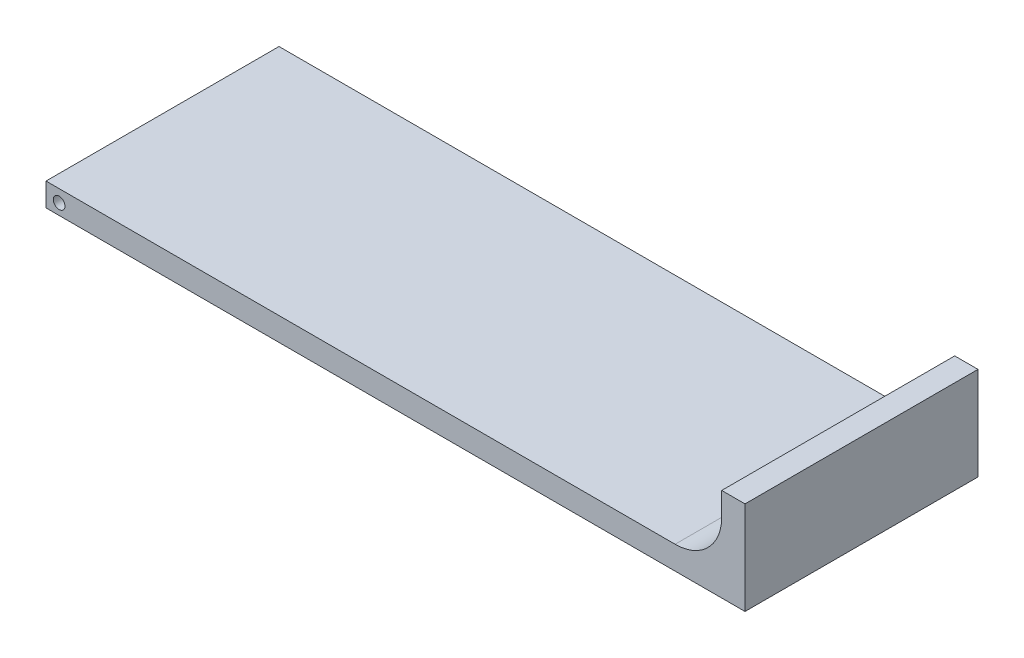
ISO-10303-21;
HEADER;
FILE_DESCRIPTION(('STEP AP214'),'2;1');
FILE_NAME('part.step','',(''),(''),'','','');
FILE_SCHEMA(('AUTOMOTIVE_DESIGN { 1 0 10303 214 1 1 1 1 }'));
ENDSEC;
DATA;
#1=APPLICATION_CONTEXT('core data for automotive mechanical design processes');
#2=APPLICATION_PROTOCOL_DEFINITION('international standard','automotive_design',2000,#1);
#3=PRODUCT_CONTEXT('',#1,'mechanical');
#4=PRODUCT('Part','Part','',(#3));
#5=PRODUCT_RELATED_PRODUCT_CATEGORY('part','',(#4));
#6=PRODUCT_DEFINITION_FORMATION('','',#4);
#7=PRODUCT_DEFINITION_CONTEXT('part definition',#1,'design');
#8=PRODUCT_DEFINITION('design','',#6,#7);
#9=PRODUCT_DEFINITION_SHAPE('','',#8);
#10=(LENGTH_UNIT() NAMED_UNIT(*) SI_UNIT(.MILLI.,.METRE.));
#11=(NAMED_UNIT(*) PLANE_ANGLE_UNIT() SI_UNIT($,.RADIAN.));
#12=(NAMED_UNIT(*) SI_UNIT($,.STERADIAN.) SOLID_ANGLE_UNIT());
#13=UNCERTAINTY_MEASURE_WITH_UNIT(LENGTH_MEASURE(1.E-05),#10,'distance_accuracy_value','');
#14=(GEOMETRIC_REPRESENTATION_CONTEXT(3) GLOBAL_UNCERTAINTY_ASSIGNED_CONTEXT((#13)) GLOBAL_UNIT_ASSIGNED_CONTEXT((#10,
#11,#12)) REPRESENTATION_CONTEXT('',''));
#15=CARTESIAN_POINT('',(0.,0.,0.));
#16=DIRECTION('',(0.,0.,1.));
#17=DIRECTION('',(1.,0.,0.));
#18=AXIS2_PLACEMENT_3D('',#15,#16,#17);
#19=CARTESIAN_POINT('',(4.,0.,10.));
#20=DIRECTION('',(1.,0.,0.));
#21=DIRECTION('',(0.,1.,0.));
#22=AXIS2_PLACEMENT_3D('',#19,#20,#21);
#23=PLANE('',#22);
#24=DIRECTION('',(0.,-1.,0.));
#25=VECTOR('',#24,1.);
#26=CARTESIAN_POINT('',(4.,0.,0.));
#27=LINE('',#26,#25);
#28=CARTESIAN_POINT('',(4.,3.,0.));
#29=VERTEX_POINT('',#28);
#30=CARTESIAN_POINT('',(4.,1.99999999999999,0.));
#31=VERTEX_POINT('',#30);
#32=EDGE_CURVE('E132',#29,#31,#27,.T.);
#33=ORIENTED_EDGE('',*,*,#32,.T.);
#34=DIRECTION('',(0.,0.,-1.));
#35=VECTOR('',#34,1.);
#36=CARTESIAN_POINT('',(4.,1.99999999999999,10.));
#37=LINE('',#36,#35);
#38=CARTESIAN_POINT('',(4.,1.99999999999999,10.));
#39=VERTEX_POINT('',#38);
#40=EDGE_CURVE('E55',#31,#39,#37,.F.);
#41=ORIENTED_EDGE('',*,*,#40,.T.);
#42=DIRECTION('',(0.,-1.,0.));
#43=VECTOR('',#42,1.);
#44=CARTESIAN_POINT('',(4.,0.,10.));
#45=LINE('',#44,#43);
#46=CARTESIAN_POINT('',(4.,3.,10.));
#47=VERTEX_POINT('',#46);
#48=EDGE_CURVE('E108',#47,#39,#45,.T.);
#49=ORIENTED_EDGE('',*,*,#48,.F.);
#50=DIRECTION('',(0.,0.,-1.));
#51=VECTOR('',#50,1.);
#52=CARTESIAN_POINT('',(4.,3.,10.));
#53=LINE('',#52,#51);
#54=EDGE_CURVE('E131',#47,#29,#53,.T.);
#55=ORIENTED_EDGE('',*,*,#54,.T.);
#56=EDGE_LOOP('',(#33,#41,#49,#55));
#57=FACE_BOUND('',#56,.T.);
#58=ADVANCED_FACE('F40',(#57),#23,.F.);
#59=CARTESIAN_POINT('',(-25.,0.,10.));
#60=DIRECTION('',(0.,-1.,0.));
#61=DIRECTION('',(1.,0.,0.));
#62=AXIS2_PLACEMENT_3D('',#59,#60,#61);
#63=PLANE('',#62);
#64=DIRECTION('',(-1.,0.,0.));
#65=VECTOR('',#64,1.);
#66=CARTESIAN_POINT('',(-25.,0.,10.));
#67=LINE('',#66,#65);
#68=CARTESIAN_POINT('',(1.99999999999999,0.,10.));
#69=VERTEX_POINT('',#68);
#70=CARTESIAN_POINT('',(-25.,0.,10.));
#71=VERTEX_POINT('',#70);
#72=EDGE_CURVE('E98',#69,#71,#67,.T.);
#73=ORIENTED_EDGE('',*,*,#72,.F.);
#74=DIRECTION('',(0.,0.,-1.));
#75=VECTOR('',#74,1.);
#76=CARTESIAN_POINT('',(1.99999999999999,0.,0.));
#77=LINE('',#76,#75);
#78=CARTESIAN_POINT('',(1.99999999999999,0.,0.));
#79=VERTEX_POINT('',#78);
#80=EDGE_CURVE('E116',#69,#79,#77,.T.);
#81=ORIENTED_EDGE('',*,*,#80,.T.);
#82=DIRECTION('',(-1.,0.,0.));
#83=VECTOR('',#82,1.);
#84=CARTESIAN_POINT('',(-25.,0.,0.));
#85=LINE('',#84,#83);
#86=CARTESIAN_POINT('',(-25.,0.,0.));
#87=VERTEX_POINT('',#86);
#88=EDGE_CURVE('E113',#79,#87,#85,.T.);
#89=ORIENTED_EDGE('',*,*,#88,.T.);
#90=DIRECTION('',(0.,0.,-1.));
#91=VECTOR('',#90,1.);
#92=CARTESIAN_POINT('',(-25.,0.,10.));
#93=LINE('',#92,#91);
#94=EDGE_CURVE('E111',#71,#87,#93,.T.);
#95=ORIENTED_EDGE('',*,*,#94,.F.);
#96=EDGE_LOOP('',(#73,#81,#89,#95));
#97=FACE_BOUND('',#96,.T.);
#98=ADVANCED_FACE('F112',(#97),#63,.F.);
#99=CARTESIAN_POINT('',(-25.,-1.00000000000001,10.));
#100=DIRECTION('',(1.,0.,0.));
#101=DIRECTION('',(0.,0.,-1.));
#102=AXIS2_PLACEMENT_3D('',#99,#100,#101);
#103=PLANE('',#102);
#104=DIRECTION('',(0.,-1.,0.));
#105=VECTOR('',#104,1.);
#106=CARTESIAN_POINT('',(-25.,-1.00000000000001,0.));
#107=LINE('',#106,#105);
#108=CARTESIAN_POINT('',(-25.,-1.00000000000001,0.));
#109=VERTEX_POINT('',#108);
#110=EDGE_CURVE('E136',#87,#109,#107,.T.);
#111=ORIENTED_EDGE('',*,*,#110,.T.);
#112=DIRECTION('',(0.,0.,-1.));
#113=VECTOR('',#112,1.);
#114=CARTESIAN_POINT('',(-25.,-1.00000000000001,10.));
#115=LINE('',#114,#113);
#116=CARTESIAN_POINT('',(-25.,-1.00000000000001,10.));
#117=VERTEX_POINT('',#116);
#118=EDGE_CURVE('E117',#117,#109,#115,.T.);
#119=ORIENTED_EDGE('',*,*,#118,.F.);
#120=DIRECTION('',(0.,-1.,0.));
#121=VECTOR('',#120,1.);
#122=CARTESIAN_POINT('',(-25.,-1.00000000000001,10.));
#123=LINE('',#122,#121);
#124=EDGE_CURVE('E102',#71,#117,#123,.T.);
#125=ORIENTED_EDGE('',*,*,#124,.F.);
#126=ORIENTED_EDGE('',*,*,#94,.T.);
#127=EDGE_LOOP('',(#111,#119,#125,#126));
#128=FACE_BOUND('',#127,.T.);
#129=ADVANCED_FACE('F119',(#128),#103,.F.);
#130=CARTESIAN_POINT('',(5.,-1.,10.));
#131=DIRECTION('',(0.,1.,0.));
#132=DIRECTION('',(-1.,0.,0.));
#133=AXIS2_PLACEMENT_3D('',#130,#131,#132);
#134=PLANE('',#133);
#135=DIRECTION('',(1.,0.,0.));
#136=VECTOR('',#135,1.);
#137=CARTESIAN_POINT('',(5.,-1.,0.));
#138=LINE('',#137,#136);
#139=CARTESIAN_POINT('',(5.,-1.,0.));
#140=VERTEX_POINT('',#139);
#141=EDGE_CURVE('E138',#109,#140,#138,.T.);
#142=ORIENTED_EDGE('',*,*,#141,.T.);
#143=DIRECTION('',(0.,0.,-1.));
#144=VECTOR('',#143,1.);
#145=CARTESIAN_POINT('',(5.,-1.,10.));
#146=LINE('',#145,#144);
#147=CARTESIAN_POINT('',(5.,-1.,10.));
#148=VERTEX_POINT('',#147);
#149=EDGE_CURVE('E149',#148,#140,#146,.T.);
#150=ORIENTED_EDGE('',*,*,#149,.F.);
#151=DIRECTION('',(1.,0.,0.));
#152=VECTOR('',#151,1.);
#153=CARTESIAN_POINT('',(5.,-1.,10.));
#154=LINE('',#153,#152);
#155=EDGE_CURVE('E122',#117,#148,#154,.T.);
#156=ORIENTED_EDGE('',*,*,#155,.F.);
#157=ORIENTED_EDGE('',*,*,#118,.T.);
#158=EDGE_LOOP('',(#142,#150,#156,#157));
#159=FACE_BOUND('',#158,.T.);
#160=ADVANCED_FACE('F159',(#159),#134,.F.);
#161=CARTESIAN_POINT('',(5.,3.,10.));
#162=DIRECTION('',(-1.,0.,0.));
#163=DIRECTION('',(0.,0.,1.));
#164=AXIS2_PLACEMENT_3D('',#161,#162,#163);
#165=PLANE('',#164);
#166=DIRECTION('',(0.,1.,0.));
#167=VECTOR('',#166,1.);
#168=CARTESIAN_POINT('',(5.,3.,0.));
#169=LINE('',#168,#167);
#170=CARTESIAN_POINT('',(5.,3.,0.));
#171=VERTEX_POINT('',#170);
#172=EDGE_CURVE('E140',#140,#171,#169,.T.);
#173=ORIENTED_EDGE('',*,*,#172,.T.);
#174=DIRECTION('',(0.,0.,-1.));
#175=VECTOR('',#174,1.);
#176=CARTESIAN_POINT('',(5.,3.,10.));
#177=LINE('',#176,#175);
#178=CARTESIAN_POINT('',(5.,3.,10.));
#179=VERTEX_POINT('',#178);
#180=EDGE_CURVE('E146',#179,#171,#177,.T.);
#181=ORIENTED_EDGE('',*,*,#180,.F.);
#182=DIRECTION('',(0.,1.,0.));
#183=VECTOR('',#182,1.);
#184=CARTESIAN_POINT('',(5.,3.,10.));
#185=LINE('',#184,#183);
#186=EDGE_CURVE('E124',#148,#179,#185,.T.);
#187=ORIENTED_EDGE('',*,*,#186,.F.);
#188=ORIENTED_EDGE('',*,*,#149,.T.);
#189=EDGE_LOOP('',(#173,#181,#187,#188));
#190=FACE_BOUND('',#189,.T.);
#191=ADVANCED_FACE('F166',(#190),#165,.F.);
#192=CARTESIAN_POINT('',(4.,3.,10.));
#193=DIRECTION('',(0.,-1.,0.));
#194=DIRECTION('',(0.,0.,-1.));
#195=AXIS2_PLACEMENT_3D('',#192,#193,#194);
#196=PLANE('',#195);
#197=DIRECTION('',(-1.,0.,0.));
#198=VECTOR('',#197,1.);
#199=CARTESIAN_POINT('',(4.,3.,0.));
#200=LINE('',#199,#198);
#201=EDGE_CURVE('E142',#171,#29,#200,.T.);
#202=ORIENTED_EDGE('',*,*,#201,.T.);
#203=ORIENTED_EDGE('',*,*,#54,.F.);
#204=DIRECTION('',(-1.,0.,0.));
#205=VECTOR('',#204,1.);
#206=CARTESIAN_POINT('',(4.,3.,10.));
#207=LINE('',#206,#205);
#208=EDGE_CURVE('E129',#179,#47,#207,.T.);
#209=ORIENTED_EDGE('',*,*,#208,.F.);
#210=ORIENTED_EDGE('',*,*,#180,.T.);
#211=EDGE_LOOP('',(#202,#203,#209,#210));
#212=FACE_BOUND('',#211,.T.);
#213=ADVANCED_FACE('F169',(#212),#196,.F.);
#214=CARTESIAN_POINT('',(0.,0.,10.));
#215=DIRECTION('',(0.,0.,-1.));
#216=DIRECTION('',(-1.,0.,0.));
#217=AXIS2_PLACEMENT_3D('',#214,#215,#216);
#218=PLANE('',#217);
#219=CARTESIAN_POINT('',(-24.4364604190234,-0.529384592267058,10.));
#220=DIRECTION('',(0.,0.,1.));
#221=DIRECTION('',(1.,0.,0.));
#222=AXIS2_PLACEMENT_3D('',#219,#220,#221);
#223=CIRCLE('',#222,0.25);
#224=CARTESIAN_POINT('',(-24.1864604190234,-0.529384592267058,10.));
#225=VERTEX_POINT('',#224);
#226=EDGE_CURVE('E171',#225,#225,#223,.T.);
#227=ORIENTED_EDGE('',*,*,#226,.F.);
#228=EDGE_LOOP('',(#227));
#229=FACE_BOUND('',#228,.T.);
#230=ORIENTED_EDGE('',*,*,#48,.T.);
#231=CARTESIAN_POINT('',(1.99999999999999,1.99999999999999,10.));
#232=DIRECTION('',(0.,0.,-1.));
#233=DIRECTION('',(-1.,0.,0.));
#234=AXIS2_PLACEMENT_3D('',#231,#232,#233);
#235=CIRCLE('',#234,2.);
#236=EDGE_CURVE('E11',#39,#69,#235,.T.);
#237=ORIENTED_EDGE('',*,*,#236,.T.);
#238=ORIENTED_EDGE('',*,*,#72,.T.);
#239=ORIENTED_EDGE('',*,*,#124,.T.);
#240=ORIENTED_EDGE('',*,*,#155,.T.);
#241=ORIENTED_EDGE('',*,*,#186,.T.);
#242=ORIENTED_EDGE('',*,*,#208,.T.);
#243=EDGE_LOOP('',(#230,#237,#238,#239,#240,#241,#242));
#244=FACE_BOUND('',#243,.T.);
#245=ADVANCED_FACE('F100',(#229,#244),#218,.F.);
#246=CARTESIAN_POINT('',(0.,0.,0.));
#247=DIRECTION('',(0.,0.,-1.));
#248=DIRECTION('',(-1.,0.,0.));
#249=AXIS2_PLACEMENT_3D('',#246,#247,#248);
#250=PLANE('',#249);
#251=CARTESIAN_POINT('',(-24.4364604190234,-0.529384592267058,0.));
#252=DIRECTION('',(0.,0.,1.));
#253=DIRECTION('',(1.,0.,0.));
#254=AXIS2_PLACEMENT_3D('',#251,#252,#253);
#255=CIRCLE('',#254,0.25);
#256=CARTESIAN_POINT('',(-24.1864604190234,-0.529384592267058,0.));
#257=VERTEX_POINT('',#256);
#258=EDGE_CURVE('E134',#257,#257,#255,.T.);
#259=ORIENTED_EDGE('',*,*,#258,.T.);
#260=EDGE_LOOP('',(#259));
#261=FACE_BOUND('',#260,.T.);
#262=ORIENTED_EDGE('',*,*,#32,.F.);
#263=ORIENTED_EDGE('',*,*,#201,.F.);
#264=ORIENTED_EDGE('',*,*,#172,.F.);
#265=ORIENTED_EDGE('',*,*,#141,.F.);
#266=ORIENTED_EDGE('',*,*,#110,.F.);
#267=ORIENTED_EDGE('',*,*,#88,.F.);
#268=CARTESIAN_POINT('',(1.99999999999999,1.99999999999999,0.));
#269=DIRECTION('',(0.,0.,-1.));
#270=DIRECTION('',(-1.,0.,0.));
#271=AXIS2_PLACEMENT_3D('',#268,#269,#270);
#272=CIRCLE('',#271,2.);
#273=EDGE_CURVE('E48',#79,#31,#272,.F.);
#274=ORIENTED_EDGE('',*,*,#273,.T.);
#275=EDGE_LOOP('',(#262,#263,#264,#265,#266,#267,#274));
#276=FACE_BOUND('',#275,.T.);
#277=ADVANCED_FACE('F155',(#261,#276),#250,.T.);
#278=CARTESIAN_POINT('',(1.99999999999999,1.99999999999999,10.));
#279=DIRECTION('',(0.,0.,1.));
#280=DIRECTION('',(1.,0.,0.));
#281=AXIS2_PLACEMENT_3D('',#278,#279,#280);
#282=CYLINDRICAL_SURFACE('',#281,2.);
#283=ORIENTED_EDGE('',*,*,#236,.F.);
#284=ORIENTED_EDGE('',*,*,#40,.F.);
#285=ORIENTED_EDGE('',*,*,#273,.F.);
#286=ORIENTED_EDGE('',*,*,#80,.F.);
#287=EDGE_LOOP('',(#283,#284,#285,#286));
#288=FACE_BOUND('',#287,.T.);
#289=ADVANCED_FACE('F42',(#288),#282,.F.);
#290=CARTESIAN_POINT('',(-24.4364604190234,-0.529384592267058,0.));
#291=DIRECTION('',(0.,0.,1.));
#292=DIRECTION('',(1.,0.,0.));
#293=AXIS2_PLACEMENT_3D('',#290,#291,#292);
#294=CYLINDRICAL_SURFACE('',#293,0.25);
#295=ORIENTED_EDGE('',*,*,#258,.F.);
#296=EDGE_LOOP('',(#295));
#297=FACE_BOUND('',#296,.T.);
#298=ORIENTED_EDGE('',*,*,#226,.T.);
#299=EDGE_LOOP('',(#298));
#300=FACE_BOUND('',#299,.T.);
#301=ADVANCED_FACE('F178',(#297,#300),#294,.F.);
#302=CLOSED_SHELL('',(#58,#98,#129,#160,#191,#213,#245,#277,#289,#301));
#303=MANIFOLD_SOLID_BREP('B2',#302);
#304=ADVANCED_BREP_SHAPE_REPRESENTATION('',(#18,#303),#14);
#305=SHAPE_DEFINITION_REPRESENTATION(#9,#304);
ENDSEC;
END-ISO-10303-21;
